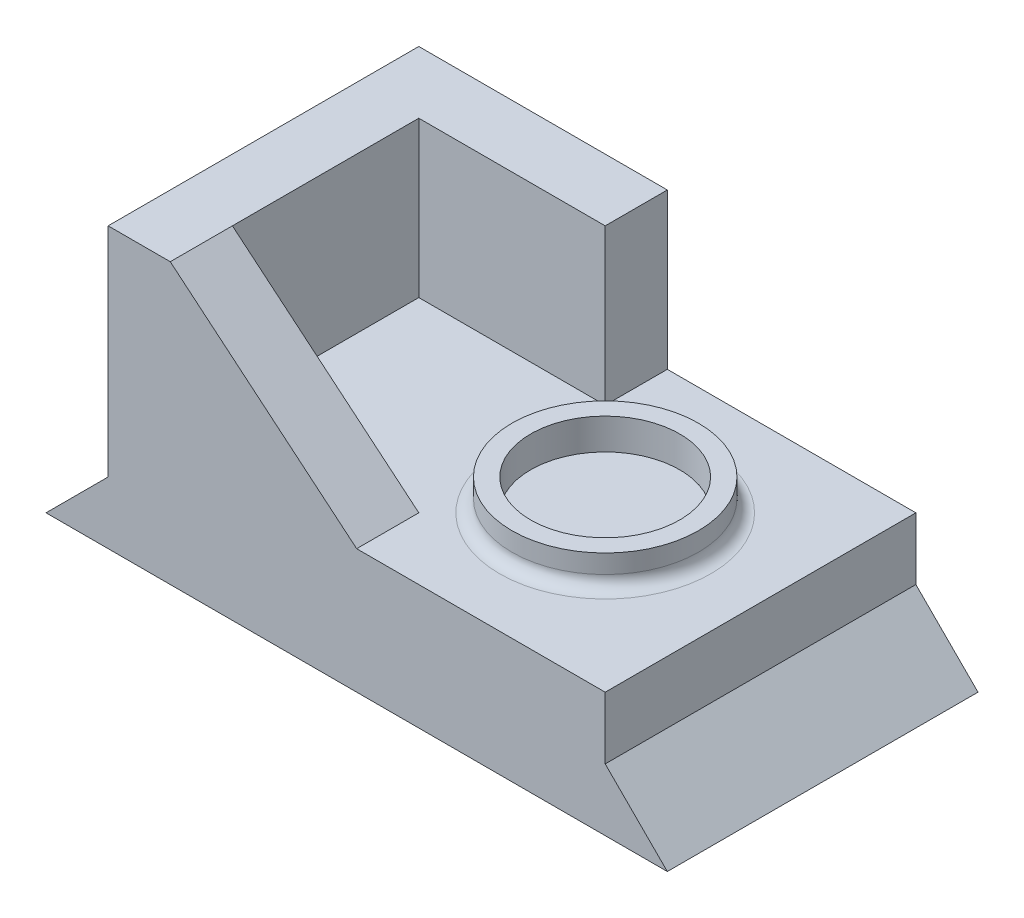
ISO-10303-21;
HEADER;
FILE_DESCRIPTION(('STEP AP214'),'2;1');
FILE_NAME('part.step','',(''),(''),'','','');
FILE_SCHEMA(('AUTOMOTIVE_DESIGN { 1 0 10303 214 1 1 1 1 }'));
ENDSEC;
DATA;
#1=APPLICATION_CONTEXT('core data for automotive mechanical design processes');
#2=APPLICATION_PROTOCOL_DEFINITION('international standard','automotive_design',2000,#1);
#3=PRODUCT_CONTEXT('',#1,'mechanical');
#4=PRODUCT('Part','Part','',(#3));
#5=PRODUCT_RELATED_PRODUCT_CATEGORY('part','',(#4));
#6=PRODUCT_DEFINITION_FORMATION('','',#4);
#7=PRODUCT_DEFINITION_CONTEXT('part definition',#1,'design');
#8=PRODUCT_DEFINITION('design','',#6,#7);
#9=PRODUCT_DEFINITION_SHAPE('','',#8);
#10=(LENGTH_UNIT() NAMED_UNIT(*) SI_UNIT(.MILLI.,.METRE.));
#11=(NAMED_UNIT(*) PLANE_ANGLE_UNIT() SI_UNIT($,.RADIAN.));
#12=(NAMED_UNIT(*) SI_UNIT($,.STERADIAN.) SOLID_ANGLE_UNIT());
#13=UNCERTAINTY_MEASURE_WITH_UNIT(LENGTH_MEASURE(1.E-05),#10,'distance_accuracy_value','');
#14=(GEOMETRIC_REPRESENTATION_CONTEXT(3) GLOBAL_UNCERTAINTY_ASSIGNED_CONTEXT((#13)) GLOBAL_UNIT_ASSIGNED_CONTEXT((#10,
#11,#12)) REPRESENTATION_CONTEXT('',''));
#15=CARTESIAN_POINT('',(0.,0.,0.));
#16=DIRECTION('',(0.,0.,1.));
#17=DIRECTION('',(1.,0.,0.));
#18=AXIS2_PLACEMENT_3D('',#15,#16,#17);
#19=CARTESIAN_POINT('',(20.,45.,0.));
#20=DIRECTION('',(1.,0.,0.));
#21=DIRECTION('',(0.,0.,-1.));
#22=AXIS2_PLACEMENT_3D('',#19,#20,#21);
#23=PLANE('',#22);
#24=DIRECTION('',(0.,0.,1.));
#25=VECTOR('',#24,1.);
#26=CARTESIAN_POINT('',(20.,45.,0.));
#27=LINE('',#26,#25);
#28=CARTESIAN_POINT('',(20.,45.,10.));
#29=VERTEX_POINT('',#28);
#30=CARTESIAN_POINT('',(20.,45.,40.));
#31=VERTEX_POINT('',#30);
#32=EDGE_CURVE('E170',#29,#31,#27,.T.);
#33=ORIENTED_EDGE('',*,*,#32,.T.);
#34=DIRECTION('',(0.,-1.,0.));
#35=VECTOR('',#34,1.);
#36=CARTESIAN_POINT('',(20.,20.,40.));
#37=LINE('',#36,#35);
#38=CARTESIAN_POINT('',(20.,20.,40.));
#39=VERTEX_POINT('',#38);
#40=EDGE_CURVE('E163',#31,#39,#37,.T.);
#41=ORIENTED_EDGE('',*,*,#40,.T.);
#42=DIRECTION('',(0.,0.,1.));
#43=VECTOR('',#42,1.);
#44=CARTESIAN_POINT('',(20.,20.,0.));
#45=LINE('',#44,#43);
#46=CARTESIAN_POINT('',(20.,20.,10.));
#47=VERTEX_POINT('',#46);
#48=EDGE_CURVE('E158',#47,#39,#45,.T.);
#49=ORIENTED_EDGE('',*,*,#48,.F.);
#50=DIRECTION('',(0.,-1.,0.));
#51=VECTOR('',#50,1.);
#52=CARTESIAN_POINT('',(20.,45.,10.));
#53=LINE('',#52,#51);
#54=EDGE_CURVE('E190',#29,#47,#53,.T.);
#55=ORIENTED_EDGE('',*,*,#54,.F.);
#56=EDGE_LOOP('',(#33,#41,#49,#55));
#57=FACE_BOUND('',#56,.T.);
#58=ADVANCED_FACE('F51',(#57),#23,.T.);
#59=CARTESIAN_POINT('',(10.,9.99999999999999,50.));
#60=DIRECTION('',(0.707106781186547,-0.707106781186548,0.));
#61=DIRECTION('',(0.707106781186548,0.707106781186547,0.));
#62=AXIS2_PLACEMENT_3D('',#59,#60,#61);
#63=PLANE('',#62);
#64=DIRECTION('',(-0.707106781186548,-0.707106781186547,0.));
#65=VECTOR('',#64,1.);
#66=CARTESIAN_POINT('',(10.,9.99999999999999,0.));
#67=LINE('',#66,#65);
#68=CARTESIAN_POINT('',(10.,9.99999999999999,0.));
#69=VERTEX_POINT('',#68);
#70=CARTESIAN_POINT('',(0.,0.,0.));
#71=VERTEX_POINT('',#70);
#72=EDGE_CURVE('E214',#69,#71,#67,.T.);
#73=ORIENTED_EDGE('',*,*,#72,.T.);
#74=DIRECTION('',(0.,0.,-1.));
#75=VECTOR('',#74,1.);
#76=CARTESIAN_POINT('',(0.,0.,50.));
#77=LINE('',#76,#75);
#78=CARTESIAN_POINT('',(0.,0.,50.));
#79=VERTEX_POINT('',#78);
#80=EDGE_CURVE('E236',#79,#71,#77,.T.);
#81=ORIENTED_EDGE('',*,*,#80,.F.);
#82=DIRECTION('',(-0.707106781186548,-0.707106781186547,0.));
#83=VECTOR('',#82,1.);
#84=CARTESIAN_POINT('',(10.,9.99999999999999,50.));
#85=LINE('',#84,#83);
#86=CARTESIAN_POINT('',(10.,9.99999999999999,50.));
#87=VERTEX_POINT('',#86);
#88=EDGE_CURVE('E215',#87,#79,#85,.T.);
#89=ORIENTED_EDGE('',*,*,#88,.F.);
#90=DIRECTION('',(0.,0.,-1.));
#91=VECTOR('',#90,1.);
#92=CARTESIAN_POINT('',(10.,9.99999999999999,50.));
#93=LINE('',#92,#91);
#94=EDGE_CURVE('E223',#87,#69,#93,.T.);
#95=ORIENTED_EDGE('',*,*,#94,.T.);
#96=EDGE_LOOP('',(#73,#81,#89,#95));
#97=FACE_BOUND('',#96,.T.);
#98=ADVANCED_FACE('F264',(#97),#63,.F.);
#99=CARTESIAN_POINT('',(0.,0.,50.));
#100=DIRECTION('',(0.,1.,0.));
#101=DIRECTION('',(0.,0.,1.));
#102=AXIS2_PLACEMENT_3D('',#99,#100,#101);
#103=PLANE('',#102);
#104=DIRECTION('',(1.,0.,0.));
#105=VECTOR('',#104,1.);
#106=CARTESIAN_POINT('',(0.,0.,0.));
#107=LINE('',#106,#105);
#108=CARTESIAN_POINT('',(100.,0.,0.));
#109=VERTEX_POINT('',#108);
#110=EDGE_CURVE('E226',#71,#109,#107,.T.);
#111=ORIENTED_EDGE('',*,*,#110,.T.);
#112=DIRECTION('',(0.,0.,-1.));
#113=VECTOR('',#112,1.);
#114=CARTESIAN_POINT('',(100.,0.,50.));
#115=LINE('',#114,#113);
#116=CARTESIAN_POINT('',(100.,0.,50.));
#117=VERTEX_POINT('',#116);
#118=EDGE_CURVE('E233',#117,#109,#115,.T.);
#119=ORIENTED_EDGE('',*,*,#118,.F.);
#120=DIRECTION('',(1.,0.,0.));
#121=VECTOR('',#120,1.);
#122=CARTESIAN_POINT('',(0.,0.,50.));
#123=LINE('',#122,#121);
#124=EDGE_CURVE('E218',#79,#117,#123,.T.);
#125=ORIENTED_EDGE('',*,*,#124,.F.);
#126=ORIENTED_EDGE('',*,*,#80,.T.);
#127=EDGE_LOOP('',(#111,#119,#125,#126));
#128=FACE_BOUND('',#127,.T.);
#129=ADVANCED_FACE('F270',(#128),#103,.F.);
#130=CARTESIAN_POINT('',(100.,0.,50.));
#131=DIRECTION('',(-0.707106781186548,-0.707106781186547,0.));
#132=DIRECTION('',(0.707106781186547,-0.707106781186548,0.));
#133=AXIS2_PLACEMENT_3D('',#130,#131,#132);
#134=PLANE('',#133);
#135=DIRECTION('',(-0.707106781186547,0.707106781186548,0.));
#136=VECTOR('',#135,1.);
#137=CARTESIAN_POINT('',(100.,0.,0.));
#138=LINE('',#137,#136);
#139=CARTESIAN_POINT('',(90.,10.,0.));
#140=VERTEX_POINT('',#139);
#141=EDGE_CURVE('E219',#109,#140,#138,.T.);
#142=ORIENTED_EDGE('',*,*,#141,.T.);
#143=DIRECTION('',(0.,0.,-1.));
#144=VECTOR('',#143,1.);
#145=CARTESIAN_POINT('',(90.,10.,50.));
#146=LINE('',#145,#144);
#147=CARTESIAN_POINT('',(90.,10.,50.));
#148=VERTEX_POINT('',#147);
#149=EDGE_CURVE('E230',#148,#140,#146,.T.);
#150=ORIENTED_EDGE('',*,*,#149,.F.);
#151=DIRECTION('',(-0.707106781186547,0.707106781186548,0.));
#152=VECTOR('',#151,1.);
#153=CARTESIAN_POINT('',(100.,0.,50.));
#154=LINE('',#153,#152);
#155=EDGE_CURVE('E221',#117,#148,#154,.T.);
#156=ORIENTED_EDGE('',*,*,#155,.F.);
#157=ORIENTED_EDGE('',*,*,#118,.T.);
#158=EDGE_LOOP('',(#142,#150,#156,#157));
#159=FACE_BOUND('',#158,.T.);
#160=ADVANCED_FACE('F295',(#159),#134,.F.);
#161=CARTESIAN_POINT('',(0.,0.,50.));
#162=DIRECTION('',(0.,0.,-1.));
#163=DIRECTION('',(-1.,0.,0.));
#164=AXIS2_PLACEMENT_3D('',#161,#162,#163);
#165=PLANE('',#164);
#166=DIRECTION('',(-1.,0.,0.));
#167=VECTOR('',#166,1.);
#168=CARTESIAN_POINT('',(10.,20.,50.));
#169=LINE('',#168,#167);
#170=CARTESIAN_POINT('',(90.,20.,50.));
#171=VERTEX_POINT('',#170);
#172=CARTESIAN_POINT('',(50.,20.,50.));
#173=VERTEX_POINT('',#172);
#174=EDGE_CURVE('E162',#171,#173,#169,.T.);
#175=ORIENTED_EDGE('',*,*,#174,.T.);
#176=DIRECTION('',(-0.768221279597376,0.64018439966448,0.));
#177=VECTOR('',#176,1.);
#178=CARTESIAN_POINT('',(20.,45.,50.));
#179=LINE('',#178,#177);
#180=CARTESIAN_POINT('',(20.,45.,50.));
#181=VERTEX_POINT('',#180);
#182=EDGE_CURVE('E155',#173,#181,#179,.T.);
#183=ORIENTED_EDGE('',*,*,#182,.T.);
#184=DIRECTION('',(1.,0.,0.));
#185=VECTOR('',#184,1.);
#186=CARTESIAN_POINT('',(0.,45.,50.));
#187=LINE('',#186,#185);
#188=CARTESIAN_POINT('',(10.,45.,50.));
#189=VERTEX_POINT('',#188);
#190=EDGE_CURVE('E137',#189,#181,#187,.T.);
#191=ORIENTED_EDGE('',*,*,#190,.F.);
#192=DIRECTION('',(0.,-1.,0.));
#193=VECTOR('',#192,1.);
#194=CARTESIAN_POINT('',(10.,20.,50.));
#195=LINE('',#194,#193);
#196=EDGE_CURVE('E198',#189,#87,#195,.T.);
#197=ORIENTED_EDGE('',*,*,#196,.T.);
#198=ORIENTED_EDGE('',*,*,#88,.T.);
#199=ORIENTED_EDGE('',*,*,#124,.T.);
#200=ORIENTED_EDGE('',*,*,#155,.T.);
#201=DIRECTION('',(0.,1.,0.));
#202=VECTOR('',#201,1.);
#203=CARTESIAN_POINT('',(90.,20.,50.));
#204=LINE('',#203,#202);
#205=EDGE_CURVE('E210',#148,#171,#204,.T.);
#206=ORIENTED_EDGE('',*,*,#205,.T.);
#207=EDGE_LOOP('',(#175,#183,#191,#197,#198,#199,#200,#206));
#208=FACE_BOUND('',#207,.T.);
#209=ADVANCED_FACE('F160',(#208),#165,.F.);
#210=CARTESIAN_POINT('',(0.,0.,0.));
#211=DIRECTION('',(0.,0.,-1.));
#212=DIRECTION('',(-1.,0.,0.));
#213=AXIS2_PLACEMENT_3D('',#210,#211,#212);
#214=PLANE('',#213);
#215=ORIENTED_EDGE('',*,*,#72,.F.);
#216=DIRECTION('',(0.,-1.,0.));
#217=VECTOR('',#216,1.);
#218=CARTESIAN_POINT('',(10.,20.,0.));
#219=LINE('',#218,#217);
#220=CARTESIAN_POINT('',(10.,45.,0.));
#221=VERTEX_POINT('',#220);
#222=EDGE_CURVE('E199',#221,#69,#219,.T.);
#223=ORIENTED_EDGE('',*,*,#222,.F.);
#224=DIRECTION('',(-1.,0.,0.));
#225=VECTOR('',#224,1.);
#226=CARTESIAN_POINT('',(0.,45.,0.));
#227=LINE('',#226,#225);
#228=CARTESIAN_POINT('',(50.,45.,0.));
#229=VERTEX_POINT('',#228);
#230=EDGE_CURVE('E178',#229,#221,#227,.T.);
#231=ORIENTED_EDGE('',*,*,#230,.F.);
#232=DIRECTION('',(0.,-1.,0.));
#233=VECTOR('',#232,1.);
#234=CARTESIAN_POINT('',(50.,45.,0.));
#235=LINE('',#234,#233);
#236=CARTESIAN_POINT('',(50.,20.,0.));
#237=VERTEX_POINT('',#236);
#238=EDGE_CURVE('E149',#229,#237,#235,.T.);
#239=ORIENTED_EDGE('',*,*,#238,.T.);
#240=DIRECTION('',(-1.,0.,0.));
#241=VECTOR('',#240,1.);
#242=CARTESIAN_POINT('',(10.,20.,0.));
#243=LINE('',#242,#241);
#244=CARTESIAN_POINT('',(90.,20.,0.));
#245=VERTEX_POINT('',#244);
#246=EDGE_CURVE('E205',#245,#237,#243,.T.);
#247=ORIENTED_EDGE('',*,*,#246,.F.);
#248=DIRECTION('',(0.,1.,0.));
#249=VECTOR('',#248,1.);
#250=CARTESIAN_POINT('',(90.,20.,0.));
#251=LINE('',#250,#249);
#252=EDGE_CURVE('E202',#140,#245,#251,.T.);
#253=ORIENTED_EDGE('',*,*,#252,.F.);
#254=ORIENTED_EDGE('',*,*,#141,.F.);
#255=ORIENTED_EDGE('',*,*,#110,.F.);
#256=EDGE_LOOP('',(#215,#223,#231,#239,#247,#253,#254,#255));
#257=FACE_BOUND('',#256,.T.);
#258=ADVANCED_FACE('F291',(#257),#214,.T.);
#259=CARTESIAN_POINT('',(10.,20.,0.));
#260=DIRECTION('',(-1.,0.,0.));
#261=DIRECTION('',(0.,0.,1.));
#262=AXIS2_PLACEMENT_3D('',#259,#260,#261);
#263=PLANE('',#262);
#264=ORIENTED_EDGE('',*,*,#196,.F.);
#265=DIRECTION('',(0.,0.,1.));
#266=VECTOR('',#265,1.);
#267=CARTESIAN_POINT('',(10.,45.,0.));
#268=LINE('',#267,#266);
#269=EDGE_CURVE('E145',#221,#189,#268,.T.);
#270=ORIENTED_EDGE('',*,*,#269,.F.);
#271=ORIENTED_EDGE('',*,*,#222,.T.);
#272=ORIENTED_EDGE('',*,*,#94,.F.);
#273=EDGE_LOOP('',(#264,#270,#271,#272));
#274=FACE_BOUND('',#273,.T.);
#275=ADVANCED_FACE('F285',(#274),#263,.T.);
#276=CARTESIAN_POINT('',(10.,20.,0.));
#277=DIRECTION('',(0.,1.,0.));
#278=DIRECTION('',(0.,0.,1.));
#279=AXIS2_PLACEMENT_3D('',#276,#277,#278);
#280=PLANE('',#279);
#281=DIRECTION('',(0.,0.,1.));
#282=VECTOR('',#281,1.);
#283=CARTESIAN_POINT('',(50.,20.,40.));
#284=LINE('',#283,#282);
#285=CARTESIAN_POINT('',(50.,20.,40.));
#286=VERTEX_POINT('',#285);
#287=EDGE_CURVE('E70',#286,#173,#284,.T.);
#288=ORIENTED_EDGE('',*,*,#287,.T.);
#289=ORIENTED_EDGE('',*,*,#174,.F.);
#290=DIRECTION('',(0.,0.,1.));
#291=VECTOR('',#290,1.);
#292=CARTESIAN_POINT('',(90.,20.,0.));
#293=LINE('',#292,#291);
#294=EDGE_CURVE('E208',#245,#171,#293,.T.);
#295=ORIENTED_EDGE('',*,*,#294,.F.);
#296=ORIENTED_EDGE('',*,*,#246,.T.);
#297=DIRECTION('',(0.,0.,1.));
#298=VECTOR('',#297,1.);
#299=CARTESIAN_POINT('',(50.,20.,0.));
#300=LINE('',#299,#298);
#301=CARTESIAN_POINT('',(50.,20.,10.));
#302=VERTEX_POINT('',#301);
#303=EDGE_CURVE('E173',#237,#302,#300,.T.);
#304=ORIENTED_EDGE('',*,*,#303,.T.);
#305=DIRECTION('',(1.,0.,0.));
#306=VECTOR('',#305,1.);
#307=CARTESIAN_POINT('',(0.,20.,10.));
#308=LINE('',#307,#306);
#309=EDGE_CURVE('E182',#47,#302,#308,.T.);
#310=ORIENTED_EDGE('',*,*,#309,.F.);
#311=ORIENTED_EDGE('',*,*,#48,.T.);
#312=DIRECTION('',(1.,0.,0.));
#313=VECTOR('',#312,1.);
#314=CARTESIAN_POINT('',(50.,20.,40.));
#315=LINE('',#314,#313);
#316=EDGE_CURVE('E66',#39,#286,#315,.T.);
#317=ORIENTED_EDGE('',*,*,#316,.T.);
#318=EDGE_LOOP('',(#288,#289,#295,#296,#304,#310,#311,#317));
#319=FACE_BOUND('',#318,.T.);
#320=CARTESIAN_POINT('',(65.,20.,25.));
#321=DIRECTION('',(0.,1.,0.));
#322=DIRECTION('',(0.,0.,1.));
#323=AXIS2_PLACEMENT_3D('',#320,#321,#322);
#324=CIRCLE('',#323,17.);
#325=CARTESIAN_POINT('',(65.,20.,42.));
#326=VERTEX_POINT('',#325);
#327=EDGE_CURVE('E11',#326,#326,#324,.F.);
#328=ORIENTED_EDGE('',*,*,#327,.T.);
#329=EDGE_LOOP('',(#328));
#330=FACE_BOUND('',#329,.T.);
#331=ADVANCED_FACE('F261',(#319,#330),#280,.T.);
#332=CARTESIAN_POINT('',(90.,20.,0.));
#333=DIRECTION('',(1.,0.,0.));
#334=DIRECTION('',(0.,0.,-1.));
#335=AXIS2_PLACEMENT_3D('',#332,#333,#334);
#336=PLANE('',#335);
#337=ORIENTED_EDGE('',*,*,#205,.F.);
#338=ORIENTED_EDGE('',*,*,#149,.T.);
#339=ORIENTED_EDGE('',*,*,#252,.T.);
#340=ORIENTED_EDGE('',*,*,#294,.T.);
#341=EDGE_LOOP('',(#337,#338,#339,#340));
#342=FACE_BOUND('',#341,.T.);
#343=ADVANCED_FACE('F280',(#342),#336,.T.);
#344=CARTESIAN_POINT('',(65.,25.,25.));
#345=DIRECTION('',(0.,1.,0.));
#346=DIRECTION('',(0.,0.,1.));
#347=AXIS2_PLACEMENT_3D('',#344,#345,#346);
#348=PLANE('',#347);
#349=CARTESIAN_POINT('',(65.,25.,25.));
#350=DIRECTION('',(0.,1.,0.));
#351=DIRECTION('',(0.,0.,1.));
#352=AXIS2_PLACEMENT_3D('',#349,#350,#351);
#353=CIRCLE('',#352,15.);
#354=CARTESIAN_POINT('',(65.,25.,40.));
#355=VERTEX_POINT('',#354);
#356=EDGE_CURVE('E195',#355,#355,#353,.T.);
#357=ORIENTED_EDGE('',*,*,#356,.T.);
#358=EDGE_LOOP('',(#357));
#359=FACE_BOUND('',#358,.T.);
#360=CARTESIAN_POINT('',(65.,25.,25.));
#361=DIRECTION('',(0.,1.,0.));
#362=DIRECTION('',(0.,0.,1.));
#363=AXIS2_PLACEMENT_3D('',#360,#361,#362);
#364=CIRCLE('',#363,12.);
#365=CARTESIAN_POINT('',(65.,25.,37.));
#366=VERTEX_POINT('',#365);
#367=EDGE_CURVE('E192',#366,#366,#364,.T.);
#368=ORIENTED_EDGE('',*,*,#367,.F.);
#369=EDGE_LOOP('',(#368));
#370=FACE_BOUND('',#369,.T.);
#371=ADVANCED_FACE('F277',(#359,#370),#348,.T.);
#372=CARTESIAN_POINT('',(65.,25.,25.));
#373=DIRECTION('',(0.,-1.,0.));
#374=DIRECTION('',(0.,0.,-1.));
#375=AXIS2_PLACEMENT_3D('',#372,#373,#374);
#376=CYLINDRICAL_SURFACE('',#375,15.);
#377=CARTESIAN_POINT('',(65.,22.,25.));
#378=DIRECTION('',(0.,1.,0.));
#379=DIRECTION('',(0.,0.,1.));
#380=AXIS2_PLACEMENT_3D('',#377,#378,#379);
#381=CIRCLE('',#380,15.);
#382=CARTESIAN_POINT('',(65.,22.,40.));
#383=VERTEX_POINT('',#382);
#384=EDGE_CURVE('E59',#383,#383,#381,.T.);
#385=ORIENTED_EDGE('',*,*,#384,.T.);
#386=EDGE_LOOP('',(#385));
#387=FACE_BOUND('',#386,.T.);
#388=ORIENTED_EDGE('',*,*,#356,.F.);
#389=EDGE_LOOP('',(#388));
#390=FACE_BOUND('',#389,.T.);
#391=ADVANCED_FACE('F244',(#387,#390),#376,.T.);
#392=CARTESIAN_POINT('',(65.,25.,25.));
#393=DIRECTION('',(0.,-1.,0.));
#394=DIRECTION('',(0.,0.,-1.));
#395=AXIS2_PLACEMENT_3D('',#392,#393,#394);
#396=CYLINDRICAL_SURFACE('',#395,12.);
#397=ORIENTED_EDGE('',*,*,#367,.T.);
#398=EDGE_LOOP('',(#397));
#399=FACE_BOUND('',#398,.T.);
#400=CARTESIAN_POINT('',(65.,20.,25.));
#401=DIRECTION('',(0.,1.,0.));
#402=DIRECTION('',(0.,0.,1.));
#403=AXIS2_PLACEMENT_3D('',#400,#401,#402);
#404=CIRCLE('',#403,12.);
#405=CARTESIAN_POINT('',(65.,20.,37.));
#406=VERTEX_POINT('',#405);
#407=EDGE_CURVE('E239',#406,#406,#404,.F.);
#408=ORIENTED_EDGE('',*,*,#407,.T.);
#409=EDGE_LOOP('',(#408));
#410=FACE_BOUND('',#409,.T.);
#411=ADVANCED_FACE('F258',(#399,#410),#396,.F.);
#412=ORIENTED_EDGE('',*,*,#407,.F.);
#413=EDGE_LOOP('',(#412));
#414=FACE_BOUND('',#413,.T.);
#415=ADVANCED_FACE('F249',(#414),#280,.T.);
#416=CARTESIAN_POINT('',(65.,22.,25.));
#417=DIRECTION('',(0.,1.,0.));
#418=DIRECTION('',(0.,0.,1.));
#419=AXIS2_PLACEMENT_3D('',#416,#417,#418);
#420=TOROIDAL_SURFACE('',#419,17.,2.);
#421=ORIENTED_EDGE('',*,*,#327,.F.);
#422=EDGE_LOOP('',(#421));
#423=FACE_BOUND('',#422,.T.);
#424=ORIENTED_EDGE('',*,*,#384,.F.);
#425=EDGE_LOOP('',(#424));
#426=FACE_BOUND('',#425,.T.);
#427=ADVANCED_FACE('F53',(#423,#426),#420,.F.);
#428=CARTESIAN_POINT('',(0.,45.,10.));
#429=DIRECTION('',(0.,0.,-1.));
#430=DIRECTION('',(-1.,0.,0.));
#431=AXIS2_PLACEMENT_3D('',#428,#429,#430);
#432=PLANE('',#431);
#433=ORIENTED_EDGE('',*,*,#309,.T.);
#434=DIRECTION('',(0.,-1.,0.));
#435=VECTOR('',#434,1.);
#436=CARTESIAN_POINT('',(50.,45.,10.));
#437=LINE('',#436,#435);
#438=CARTESIAN_POINT('',(50.,45.,10.));
#439=VERTEX_POINT('',#438);
#440=EDGE_CURVE('E188',#439,#302,#437,.T.);
#441=ORIENTED_EDGE('',*,*,#440,.F.);
#442=DIRECTION('',(1.,0.,0.));
#443=VECTOR('',#442,1.);
#444=CARTESIAN_POINT('',(0.,45.,10.));
#445=LINE('',#444,#443);
#446=EDGE_CURVE('E172',#29,#439,#445,.T.);
#447=ORIENTED_EDGE('',*,*,#446,.F.);
#448=ORIENTED_EDGE('',*,*,#54,.T.);
#449=EDGE_LOOP('',(#433,#441,#447,#448));
#450=FACE_BOUND('',#449,.T.);
#451=ADVANCED_FACE('F248',(#450),#432,.F.);
#452=CARTESIAN_POINT('',(50.,45.,0.));
#453=DIRECTION('',(1.,0.,0.));
#454=DIRECTION('',(0.,0.,-1.));
#455=AXIS2_PLACEMENT_3D('',#452,#453,#454);
#456=PLANE('',#455);
#457=ORIENTED_EDGE('',*,*,#303,.F.);
#458=ORIENTED_EDGE('',*,*,#238,.F.);
#459=DIRECTION('',(0.,0.,1.));
#460=VECTOR('',#459,1.);
#461=CARTESIAN_POINT('',(50.,45.,0.));
#462=LINE('',#461,#460);
#463=EDGE_CURVE('E175',#229,#439,#462,.T.);
#464=ORIENTED_EDGE('',*,*,#463,.T.);
#465=ORIENTED_EDGE('',*,*,#440,.T.);
#466=EDGE_LOOP('',(#457,#458,#464,#465));
#467=FACE_BOUND('',#466,.T.);
#468=ADVANCED_FACE('F255',(#467),#456,.T.);
#469=CARTESIAN_POINT('',(0.,45.,0.));
#470=DIRECTION('',(0.,1.,0.));
#471=DIRECTION('',(0.,0.,1.));
#472=AXIS2_PLACEMENT_3D('',#469,#470,#471);
#473=PLANE('',#472);
#474=ORIENTED_EDGE('',*,*,#32,.F.);
#475=ORIENTED_EDGE('',*,*,#446,.T.);
#476=ORIENTED_EDGE('',*,*,#463,.F.);
#477=ORIENTED_EDGE('',*,*,#230,.T.);
#478=ORIENTED_EDGE('',*,*,#269,.T.);
#479=ORIENTED_EDGE('',*,*,#190,.T.);
#480=DIRECTION('',(0.,0.,1.));
#481=VECTOR('',#480,1.);
#482=CARTESIAN_POINT('',(20.,45.,40.));
#483=LINE('',#482,#481);
#484=EDGE_CURVE('E141',#31,#181,#483,.T.);
#485=ORIENTED_EDGE('',*,*,#484,.F.);
#486=EDGE_LOOP('',(#474,#475,#476,#477,#478,#479,#485));
#487=FACE_BOUND('',#486,.T.);
#488=ADVANCED_FACE('F140',(#487),#473,.T.);
#489=CARTESIAN_POINT('',(20.,45.,40.));
#490=DIRECTION('',(0.64018439966448,0.768221279597376,0.));
#491=DIRECTION('',(-0.768221279597376,0.64018439966448,0.));
#492=AXIS2_PLACEMENT_3D('',#489,#490,#491);
#493=PLANE('',#492);
#494=ORIENTED_EDGE('',*,*,#182,.F.);
#495=ORIENTED_EDGE('',*,*,#287,.F.);
#496=DIRECTION('',(-0.768221279597376,0.64018439966448,0.));
#497=VECTOR('',#496,1.);
#498=CARTESIAN_POINT('',(20.,45.,40.));
#499=LINE('',#498,#497);
#500=EDGE_CURVE('E157',#286,#31,#499,.T.);
#501=ORIENTED_EDGE('',*,*,#500,.T.);
#502=ORIENTED_EDGE('',*,*,#484,.T.);
#503=EDGE_LOOP('',(#494,#495,#501,#502));
#504=FACE_BOUND('',#503,.T.);
#505=ADVANCED_FACE('F154',(#504),#493,.T.);
#506=CARTESIAN_POINT('',(0.,0.,40.));
#507=DIRECTION('',(0.,0.,1.));
#508=DIRECTION('',(1.,0.,0.));
#509=AXIS2_PLACEMENT_3D('',#506,#507,#508);
#510=PLANE('',#509);
#511=ORIENTED_EDGE('',*,*,#40,.F.);
#512=ORIENTED_EDGE('',*,*,#500,.F.);
#513=ORIENTED_EDGE('',*,*,#316,.F.);
#514=EDGE_LOOP('',(#511,#512,#513));
#515=FACE_BOUND('',#514,.T.);
#516=ADVANCED_FACE('F326',(#515),#510,.F.);
#517=CLOSED_SHELL('',(#58,#98,#129,#160,#209,#258,#275,#331,#343,#371,#391,#411,#415,#427,#451,
#468,#488,#505,#516));
#518=MANIFOLD_SOLID_BREP('B2',#517);
#519=ADVANCED_BREP_SHAPE_REPRESENTATION('',(#18,#518),#14);
#520=SHAPE_DEFINITION_REPRESENTATION(#9,#519);
ENDSEC;
END-ISO-10303-21;
